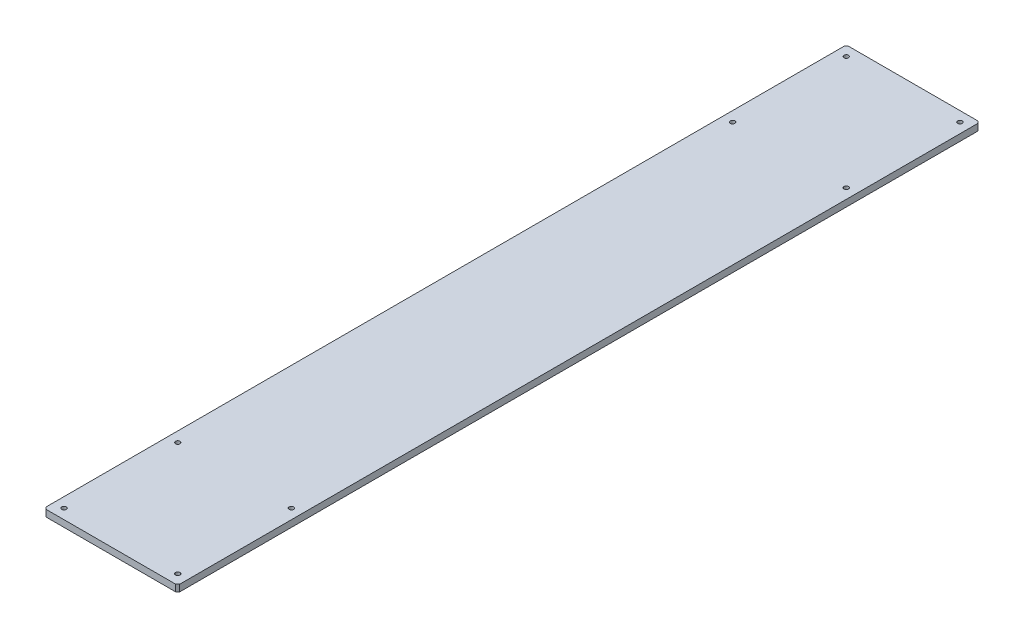
ISO-10303-21;
HEADER;
FILE_DESCRIPTION(('STEP AP214'),'2;1');
FILE_NAME('part.step','',(''),(''),'','','');
FILE_SCHEMA(('AUTOMOTIVE_DESIGN { 1 0 10303 214 1 1 1 1 }'));
ENDSEC;
DATA;
#1=APPLICATION_CONTEXT('core data for automotive mechanical design processes');
#2=APPLICATION_PROTOCOL_DEFINITION('international standard','automotive_design',2000,#1);
#3=PRODUCT_CONTEXT('',#1,'mechanical');
#4=PRODUCT('Part','Part','',(#3));
#5=PRODUCT_RELATED_PRODUCT_CATEGORY('part','',(#4));
#6=PRODUCT_DEFINITION_FORMATION('','',#4);
#7=PRODUCT_DEFINITION_CONTEXT('part definition',#1,'design');
#8=PRODUCT_DEFINITION('design','',#6,#7);
#9=PRODUCT_DEFINITION_SHAPE('','',#8);
#10=(LENGTH_UNIT() NAMED_UNIT(*) SI_UNIT(.MILLI.,.METRE.));
#11=(NAMED_UNIT(*) PLANE_ANGLE_UNIT() SI_UNIT($,.RADIAN.));
#12=(NAMED_UNIT(*) SI_UNIT($,.STERADIAN.) SOLID_ANGLE_UNIT());
#13=UNCERTAINTY_MEASURE_WITH_UNIT(LENGTH_MEASURE(1.E-05),#10,'distance_accuracy_value','');
#14=(GEOMETRIC_REPRESENTATION_CONTEXT(3) GLOBAL_UNCERTAINTY_ASSIGNED_CONTEXT((#13)) GLOBAL_UNIT_ASSIGNED_CONTEXT((#10,
#11,#12)) REPRESENTATION_CONTEXT('',''));
#15=CARTESIAN_POINT('',(0.,0.,0.));
#16=DIRECTION('',(0.,0.,1.));
#17=DIRECTION('',(1.,0.,0.));
#18=AXIS2_PLACEMENT_3D('',#15,#16,#17);
#19=CARTESIAN_POINT('',(1.16341445918999E-13,10.,-600.));
#20=DIRECTION('',(1.,0.,0.));
#21=DIRECTION('',(0.,0.,-1.));
#22=AXIS2_PLACEMENT_3D('',#19,#20,#21);
#23=PLANE('',#22);
#24=DIRECTION('',(0.,0.,1.));
#25=VECTOR('',#24,1.);
#26=CARTESIAN_POINT('',(1.16341445918999E-13,0.,-600.));
#27=LINE('',#26,#25);
#28=CARTESIAN_POINT('',(1.16341445918999E-13,0.,-597.));
#29=VERTEX_POINT('',#28);
#30=CARTESIAN_POINT('',(1.16341445918999E-13,0.,597.));
#31=VERTEX_POINT('',#30);
#32=EDGE_CURVE('E138',#29,#31,#27,.T.);
#33=ORIENTED_EDGE('',*,*,#32,.T.);
#34=DIRECTION('',(0.,1.,0.));
#35=VECTOR('',#34,1.);
#36=CARTESIAN_POINT('',(1.16341445918999E-13,10.,597.));
#37=LINE('',#36,#35);
#38=CARTESIAN_POINT('',(1.16341445918999E-13,10.,597.));
#39=VERTEX_POINT('',#38);
#40=EDGE_CURVE('E116',#31,#39,#37,.T.);
#41=ORIENTED_EDGE('',*,*,#40,.T.);
#42=DIRECTION('',(0.,0.,1.));
#43=VECTOR('',#42,1.);
#44=CARTESIAN_POINT('',(1.16341445918999E-13,10.,-600.));
#45=LINE('',#44,#43);
#46=CARTESIAN_POINT('',(1.16341445918999E-13,10.,-597.));
#47=VERTEX_POINT('',#46);
#48=EDGE_CURVE('E148',#47,#39,#45,.T.);
#49=ORIENTED_EDGE('',*,*,#48,.F.);
#50=DIRECTION('',(0.,-1.,0.));
#51=VECTOR('',#50,1.);
#52=CARTESIAN_POINT('',(1.16341445918999E-13,10.,-597.));
#53=LINE('',#52,#51);
#54=EDGE_CURVE('E121',#47,#29,#53,.T.);
#55=ORIENTED_EDGE('',*,*,#54,.T.);
#56=EDGE_LOOP('',(#33,#41,#49,#55));
#57=FACE_BOUND('',#56,.T.);
#58=ADVANCED_FACE('F45',(#57),#23,.F.);
#59=CARTESIAN_POINT('',(1.16341445918999E-13,10.,600.));
#60=DIRECTION('',(0.,0.,-1.));
#61=DIRECTION('',(-1.,0.,0.));
#62=AXIS2_PLACEMENT_3D('',#59,#60,#61);
#63=PLANE('',#62);
#64=DIRECTION('',(1.,0.,0.));
#65=VECTOR('',#64,1.);
#66=CARTESIAN_POINT('',(1.16341445918999E-13,10.,600.));
#67=LINE('',#66,#65);
#68=CARTESIAN_POINT('',(3.00000000000012,10.,600.));
#69=VERTEX_POINT('',#68);
#70=CARTESIAN_POINT('',(197.,10.,600.));
#71=VERTEX_POINT('',#70);
#72=EDGE_CURVE('E131',#69,#71,#67,.T.);
#73=ORIENTED_EDGE('',*,*,#72,.F.);
#74=DIRECTION('',(0.,-1.,0.));
#75=VECTOR('',#74,1.);
#76=CARTESIAN_POINT('',(3.00000000000012,10.,600.));
#77=LINE('',#76,#75);
#78=CARTESIAN_POINT('',(3.00000000000012,0.,600.));
#79=VERTEX_POINT('',#78);
#80=EDGE_CURVE('E115',#69,#79,#77,.T.);
#81=ORIENTED_EDGE('',*,*,#80,.T.);
#82=DIRECTION('',(1.,0.,0.));
#83=VECTOR('',#82,1.);
#84=CARTESIAN_POINT('',(1.16341445918999E-13,0.,600.));
#85=LINE('',#84,#83);
#86=CARTESIAN_POINT('',(197.,0.,600.));
#87=VERTEX_POINT('',#86);
#88=EDGE_CURVE('E128',#79,#87,#85,.T.);
#89=ORIENTED_EDGE('',*,*,#88,.T.);
#90=DIRECTION('',(0.,1.,0.));
#91=VECTOR('',#90,1.);
#92=CARTESIAN_POINT('',(197.,10.,600.));
#93=LINE('',#92,#91);
#94=EDGE_CURVE('E133',#87,#71,#93,.T.);
#95=ORIENTED_EDGE('',*,*,#94,.T.);
#96=EDGE_LOOP('',(#73,#81,#89,#95));
#97=FACE_BOUND('',#96,.T.);
#98=ADVANCED_FACE('F127',(#97),#63,.F.);
#99=CARTESIAN_POINT('',(200.,10.,-600.));
#100=DIRECTION('',(-1.,0.,0.));
#101=DIRECTION('',(0.,0.,1.));
#102=AXIS2_PLACEMENT_3D('',#99,#100,#101);
#103=PLANE('',#102);
#104=DIRECTION('',(0.,0.,-1.));
#105=VECTOR('',#104,1.);
#106=CARTESIAN_POINT('',(200.,10.,-600.));
#107=LINE('',#106,#105);
#108=CARTESIAN_POINT('',(200.,10.,597.));
#109=VERTEX_POINT('',#108);
#110=CARTESIAN_POINT('',(200.,10.,-597.));
#111=VERTEX_POINT('',#110);
#112=EDGE_CURVE('E174',#109,#111,#107,.T.);
#113=ORIENTED_EDGE('',*,*,#112,.F.);
#114=DIRECTION('',(0.,-1.,0.));
#115=VECTOR('',#114,1.);
#116=CARTESIAN_POINT('',(200.,10.,597.));
#117=LINE('',#116,#115);
#118=CARTESIAN_POINT('',(200.,0.,597.));
#119=VERTEX_POINT('',#118);
#120=EDGE_CURVE('E167',#109,#119,#117,.T.);
#121=ORIENTED_EDGE('',*,*,#120,.T.);
#122=DIRECTION('',(0.,0.,-1.));
#123=VECTOR('',#122,1.);
#124=CARTESIAN_POINT('',(200.,0.,-600.));
#125=LINE('',#124,#123);
#126=CARTESIAN_POINT('',(200.,0.,-597.));
#127=VERTEX_POINT('',#126);
#128=EDGE_CURVE('E137',#119,#127,#125,.T.);
#129=ORIENTED_EDGE('',*,*,#128,.T.);
#130=DIRECTION('',(0.,1.,0.));
#131=VECTOR('',#130,1.);
#132=CARTESIAN_POINT('',(200.,10.,-597.));
#133=LINE('',#132,#131);
#134=EDGE_CURVE('E165',#127,#111,#133,.T.);
#135=ORIENTED_EDGE('',*,*,#134,.T.);
#136=EDGE_LOOP('',(#113,#121,#129,#135));
#137=FACE_BOUND('',#136,.T.);
#138=ADVANCED_FACE('F172',(#137),#103,.F.);
#139=CARTESIAN_POINT('',(1.16341445918999E-13,10.,-600.));
#140=DIRECTION('',(0.,0.,1.));
#141=DIRECTION('',(1.,0.,0.));
#142=AXIS2_PLACEMENT_3D('',#139,#140,#141);
#143=PLANE('',#142);
#144=DIRECTION('',(-1.,0.,0.));
#145=VECTOR('',#144,1.);
#146=CARTESIAN_POINT('',(1.16341445918999E-13,10.,-600.));
#147=LINE('',#146,#145);
#148=CARTESIAN_POINT('',(197.,10.,-600.));
#149=VERTEX_POINT('',#148);
#150=CARTESIAN_POINT('',(3.00000000000012,10.,-600.));
#151=VERTEX_POINT('',#150);
#152=EDGE_CURVE('E149',#149,#151,#147,.T.);
#153=ORIENTED_EDGE('',*,*,#152,.F.);
#154=DIRECTION('',(0.,-1.,0.));
#155=VECTOR('',#154,1.);
#156=CARTESIAN_POINT('',(197.,10.,-600.));
#157=LINE('',#156,#155);
#158=CARTESIAN_POINT('',(197.,0.,-600.));
#159=VERTEX_POINT('',#158);
#160=EDGE_CURVE('E11',#149,#159,#157,.T.);
#161=ORIENTED_EDGE('',*,*,#160,.T.);
#162=DIRECTION('',(-1.,0.,0.));
#163=VECTOR('',#162,1.);
#164=CARTESIAN_POINT('',(1.16341445918999E-13,0.,-600.));
#165=LINE('',#164,#163);
#166=CARTESIAN_POINT('',(3.00000000000012,0.,-600.));
#167=VERTEX_POINT('',#166);
#168=EDGE_CURVE('E141',#159,#167,#165,.T.);
#169=ORIENTED_EDGE('',*,*,#168,.T.);
#170=DIRECTION('',(0.,1.,0.));
#171=VECTOR('',#170,1.);
#172=CARTESIAN_POINT('',(3.00000000000012,10.,-600.));
#173=LINE('',#172,#171);
#174=EDGE_CURVE('E53',#167,#151,#173,.T.);
#175=ORIENTED_EDGE('',*,*,#174,.T.);
#176=EDGE_LOOP('',(#153,#161,#169,#175));
#177=FACE_BOUND('',#176,.T.);
#178=ADVANCED_FACE('F181',(#177),#143,.F.);
#179=CARTESIAN_POINT('',(1.16341445918999E-13,10.,600.));
#180=DIRECTION('',(0.,1.,0.));
#181=DIRECTION('',(0.,0.,1.));
#182=AXIS2_PLACEMENT_3D('',#179,#180,#181);
#183=PLANE('',#182);
#184=CARTESIAN_POINT('',(15.,10.,-585.));
#185=DIRECTION('',(0.,1.,0.));
#186=DIRECTION('',(0.,0.,1.));
#187=AXIS2_PLACEMENT_3D('',#184,#185,#186);
#188=CIRCLE('',#187,3.39999999999999);
#189=CARTESIAN_POINT('',(15.,10.,-581.6));
#190=VERTEX_POINT('',#189);
#191=EDGE_CURVE('E232',#190,#190,#188,.T.);
#192=ORIENTED_EDGE('',*,*,#191,.F.);
#193=EDGE_LOOP('',(#192));
#194=FACE_BOUND('',#193,.T.);
#195=CARTESIAN_POINT('',(15.,10.,-415.));
#196=DIRECTION('',(0.,1.,0.));
#197=DIRECTION('',(0.,0.,1.));
#198=AXIS2_PLACEMENT_3D('',#195,#196,#197);
#199=CIRCLE('',#198,3.39999999999999);
#200=CARTESIAN_POINT('',(15.,10.,-411.6));
#201=VERTEX_POINT('',#200);
#202=EDGE_CURVE('E226',#201,#201,#199,.T.);
#203=ORIENTED_EDGE('',*,*,#202,.F.);
#204=EDGE_LOOP('',(#203));
#205=FACE_BOUND('',#204,.T.);
#206=CARTESIAN_POINT('',(185.,10.,-415.));
#207=DIRECTION('',(0.,1.,0.));
#208=DIRECTION('',(0.,0.,1.));
#209=AXIS2_PLACEMENT_3D('',#206,#207,#208);
#210=CIRCLE('',#209,3.39999999999999);
#211=CARTESIAN_POINT('',(185.,10.,-411.6));
#212=VERTEX_POINT('',#211);
#213=EDGE_CURVE('E220',#212,#212,#210,.T.);
#214=ORIENTED_EDGE('',*,*,#213,.F.);
#215=EDGE_LOOP('',(#214));
#216=FACE_BOUND('',#215,.T.);
#217=CARTESIAN_POINT('',(185.,10.,-585.));
#218=DIRECTION('',(0.,1.,0.));
#219=DIRECTION('',(0.,0.,1.));
#220=AXIS2_PLACEMENT_3D('',#217,#218,#219);
#221=CIRCLE('',#220,3.39999999999999);
#222=CARTESIAN_POINT('',(185.,10.,-581.6));
#223=VERTEX_POINT('',#222);
#224=EDGE_CURVE('E214',#223,#223,#221,.T.);
#225=ORIENTED_EDGE('',*,*,#224,.F.);
#226=EDGE_LOOP('',(#225));
#227=FACE_BOUND('',#226,.T.);
#228=CARTESIAN_POINT('',(185.,10.,415.));
#229=DIRECTION('',(0.,1.,0.));
#230=DIRECTION('',(0.,0.,1.));
#231=AXIS2_PLACEMENT_3D('',#228,#229,#230);
#232=CIRCLE('',#231,3.39999999999999);
#233=CARTESIAN_POINT('',(185.,10.,418.4));
#234=VERTEX_POINT('',#233);
#235=EDGE_CURVE('E208',#234,#234,#232,.T.);
#236=ORIENTED_EDGE('',*,*,#235,.F.);
#237=EDGE_LOOP('',(#236));
#238=FACE_BOUND('',#237,.T.);
#239=CARTESIAN_POINT('',(185.,10.,585.));
#240=DIRECTION('',(0.,1.,0.));
#241=DIRECTION('',(0.,0.,1.));
#242=AXIS2_PLACEMENT_3D('',#239,#240,#241);
#243=CIRCLE('',#242,3.39999999999999);
#244=CARTESIAN_POINT('',(185.,10.,588.4));
#245=VERTEX_POINT('',#244);
#246=EDGE_CURVE('E202',#245,#245,#243,.T.);
#247=ORIENTED_EDGE('',*,*,#246,.F.);
#248=EDGE_LOOP('',(#247));
#249=FACE_BOUND('',#248,.T.);
#250=CARTESIAN_POINT('',(15.0000000000001,10.,585.));
#251=DIRECTION('',(0.,1.,0.));
#252=DIRECTION('',(0.,0.,1.));
#253=AXIS2_PLACEMENT_3D('',#250,#251,#252);
#254=CIRCLE('',#253,3.39999999999999);
#255=CARTESIAN_POINT('',(15.0000000000001,10.,588.4));
#256=VERTEX_POINT('',#255);
#257=EDGE_CURVE('E196',#256,#256,#254,.T.);
#258=ORIENTED_EDGE('',*,*,#257,.F.);
#259=EDGE_LOOP('',(#258));
#260=FACE_BOUND('',#259,.T.);
#261=CARTESIAN_POINT('',(15.0000000000001,10.,415.));
#262=DIRECTION('',(0.,1.,0.));
#263=DIRECTION('',(0.,0.,1.));
#264=AXIS2_PLACEMENT_3D('',#261,#262,#263);
#265=CIRCLE('',#264,3.39999999999999);
#266=CARTESIAN_POINT('',(15.0000000000001,10.,418.4));
#267=VERTEX_POINT('',#266);
#268=EDGE_CURVE('E190',#267,#267,#265,.T.);
#269=ORIENTED_EDGE('',*,*,#268,.F.);
#270=EDGE_LOOP('',(#269));
#271=FACE_BOUND('',#270,.T.);
#272=ORIENTED_EDGE('',*,*,#48,.T.);
#273=DIRECTION('',(-0.707106781186561,0.,-0.707106781186534));
#274=VECTOR('',#273,1.);
#275=CARTESIAN_POINT('',(1.50000000000006,10.,598.5));
#276=LINE('',#275,#274);
#277=EDGE_CURVE('E163',#39,#69,#276,.F.);
#278=ORIENTED_EDGE('',*,*,#277,.T.);
#279=ORIENTED_EDGE('',*,*,#72,.T.);
#280=DIRECTION('',(-0.707106781186561,0.,0.707106781186534));
#281=VECTOR('',#280,1.);
#282=CARTESIAN_POINT('',(98.4999999999965,10.,698.5));
#283=LINE('',#282,#281);
#284=EDGE_CURVE('E161',#71,#109,#283,.F.);
#285=ORIENTED_EDGE('',*,*,#284,.T.);
#286=ORIENTED_EDGE('',*,*,#112,.T.);
#287=DIRECTION('',(0.707106781186548,0.,0.707106781186548));
#288=VECTOR('',#287,1.);
#289=CARTESIAN_POINT('',(698.5,10.,-98.4999999999998));
#290=LINE('',#289,#288);
#291=EDGE_CURVE('E66',#111,#149,#290,.F.);
#292=ORIENTED_EDGE('',*,*,#291,.T.);
#293=ORIENTED_EDGE('',*,*,#152,.T.);
#294=DIRECTION('',(0.707106781186548,0.,-0.707106781186548));
#295=VECTOR('',#294,1.);
#296=CARTESIAN_POINT('',(-598.5,10.,1.49999999999995));
#297=LINE('',#296,#295);
#298=EDGE_CURVE('E158',#151,#47,#297,.F.);
#299=ORIENTED_EDGE('',*,*,#298,.T.);
#300=EDGE_LOOP('',(#272,#278,#279,#285,#286,#292,#293,#299));
#301=FACE_BOUND('',#300,.T.);
#302=ADVANCED_FACE('F238',(#194,#205,#216,#227,#238,#249,#260,#271,#301),#183,.T.);
#303=CARTESIAN_POINT('',(1.16341445918999E-13,0.,600.));
#304=DIRECTION('',(0.,1.,0.));
#305=DIRECTION('',(0.,0.,1.));
#306=AXIS2_PLACEMENT_3D('',#303,#304,#305);
#307=PLANE('',#306);
#308=CARTESIAN_POINT('',(15.,0.,-585.));
#309=DIRECTION('',(0.,1.,0.));
#310=DIRECTION('',(0.,0.,1.));
#311=AXIS2_PLACEMENT_3D('',#308,#309,#310);
#312=CIRCLE('',#311,3.4);
#313=CARTESIAN_POINT('',(15.,0.,-581.6));
#314=VERTEX_POINT('',#313);
#315=EDGE_CURVE('E229',#314,#314,#312,.T.);
#316=ORIENTED_EDGE('',*,*,#315,.T.);
#317=EDGE_LOOP('',(#316));
#318=FACE_BOUND('',#317,.T.);
#319=CARTESIAN_POINT('',(15.,0.,-415.));
#320=DIRECTION('',(0.,1.,0.));
#321=DIRECTION('',(0.,0.,1.));
#322=AXIS2_PLACEMENT_3D('',#319,#320,#321);
#323=CIRCLE('',#322,3.4);
#324=CARTESIAN_POINT('',(15.,0.,-411.6));
#325=VERTEX_POINT('',#324);
#326=EDGE_CURVE('E223',#325,#325,#323,.T.);
#327=ORIENTED_EDGE('',*,*,#326,.T.);
#328=EDGE_LOOP('',(#327));
#329=FACE_BOUND('',#328,.T.);
#330=CARTESIAN_POINT('',(185.,0.,-415.));
#331=DIRECTION('',(0.,1.,0.));
#332=DIRECTION('',(0.,0.,1.));
#333=AXIS2_PLACEMENT_3D('',#330,#331,#332);
#334=CIRCLE('',#333,3.39999999999999);
#335=CARTESIAN_POINT('',(185.,0.,-411.6));
#336=VERTEX_POINT('',#335);
#337=EDGE_CURVE('E217',#336,#336,#334,.T.);
#338=ORIENTED_EDGE('',*,*,#337,.T.);
#339=EDGE_LOOP('',(#338));
#340=FACE_BOUND('',#339,.T.);
#341=CARTESIAN_POINT('',(185.,0.,-585.));
#342=DIRECTION('',(0.,1.,0.));
#343=DIRECTION('',(0.,0.,1.));
#344=AXIS2_PLACEMENT_3D('',#341,#342,#343);
#345=CIRCLE('',#344,3.39999999999999);
#346=CARTESIAN_POINT('',(185.,0.,-581.6));
#347=VERTEX_POINT('',#346);
#348=EDGE_CURVE('E211',#347,#347,#345,.T.);
#349=ORIENTED_EDGE('',*,*,#348,.T.);
#350=EDGE_LOOP('',(#349));
#351=FACE_BOUND('',#350,.T.);
#352=CARTESIAN_POINT('',(185.,0.,415.));
#353=DIRECTION('',(0.,1.,0.));
#354=DIRECTION('',(0.,0.,1.));
#355=AXIS2_PLACEMENT_3D('',#352,#353,#354);
#356=CIRCLE('',#355,3.39999999999999);
#357=CARTESIAN_POINT('',(185.,0.,418.4));
#358=VERTEX_POINT('',#357);
#359=EDGE_CURVE('E205',#358,#358,#356,.T.);
#360=ORIENTED_EDGE('',*,*,#359,.T.);
#361=EDGE_LOOP('',(#360));
#362=FACE_BOUND('',#361,.T.);
#363=CARTESIAN_POINT('',(185.,0.,585.));
#364=DIRECTION('',(0.,1.,0.));
#365=DIRECTION('',(0.,0.,1.));
#366=AXIS2_PLACEMENT_3D('',#363,#364,#365);
#367=CIRCLE('',#366,3.39999999999999);
#368=CARTESIAN_POINT('',(185.,0.,588.4));
#369=VERTEX_POINT('',#368);
#370=EDGE_CURVE('E199',#369,#369,#367,.T.);
#371=ORIENTED_EDGE('',*,*,#370,.T.);
#372=EDGE_LOOP('',(#371));
#373=FACE_BOUND('',#372,.T.);
#374=CARTESIAN_POINT('',(15.0000000000001,0.,585.));
#375=DIRECTION('',(0.,1.,0.));
#376=DIRECTION('',(0.,0.,1.));
#377=AXIS2_PLACEMENT_3D('',#374,#375,#376);
#378=CIRCLE('',#377,3.4);
#379=CARTESIAN_POINT('',(15.0000000000001,0.,588.4));
#380=VERTEX_POINT('',#379);
#381=EDGE_CURVE('E193',#380,#380,#378,.T.);
#382=ORIENTED_EDGE('',*,*,#381,.T.);
#383=EDGE_LOOP('',(#382));
#384=FACE_BOUND('',#383,.T.);
#385=CARTESIAN_POINT('',(15.0000000000001,0.,415.));
#386=DIRECTION('',(0.,1.,0.));
#387=DIRECTION('',(0.,0.,1.));
#388=AXIS2_PLACEMENT_3D('',#385,#386,#387);
#389=CIRCLE('',#388,3.4);
#390=CARTESIAN_POINT('',(15.0000000000001,0.,418.4));
#391=VERTEX_POINT('',#390);
#392=EDGE_CURVE('E143',#391,#391,#389,.T.);
#393=ORIENTED_EDGE('',*,*,#392,.T.);
#394=EDGE_LOOP('',(#393));
#395=FACE_BOUND('',#394,.T.);
#396=ORIENTED_EDGE('',*,*,#88,.F.);
#397=DIRECTION('',(0.707106781186561,0.,0.707106781186534));
#398=VECTOR('',#397,1.);
#399=CARTESIAN_POINT('',(3.00000000000012,0.,600.));
#400=LINE('',#399,#398);
#401=EDGE_CURVE('E111',#79,#31,#400,.F.);
#402=ORIENTED_EDGE('',*,*,#401,.T.);
#403=ORIENTED_EDGE('',*,*,#32,.F.);
#404=DIRECTION('',(-0.707106781186548,0.,0.707106781186548));
#405=VECTOR('',#404,1.);
#406=CARTESIAN_POINT('',(1.16341445918999E-13,0.,-597.));
#407=LINE('',#406,#405);
#408=EDGE_CURVE('E132',#29,#167,#407,.F.);
#409=ORIENTED_EDGE('',*,*,#408,.T.);
#410=ORIENTED_EDGE('',*,*,#168,.F.);
#411=DIRECTION('',(-0.707106781186548,0.,-0.707106781186548));
#412=VECTOR('',#411,1.);
#413=CARTESIAN_POINT('',(197.,0.,-600.));
#414=LINE('',#413,#412);
#415=EDGE_CURVE('E152',#159,#127,#414,.F.);
#416=ORIENTED_EDGE('',*,*,#415,.T.);
#417=ORIENTED_EDGE('',*,*,#128,.F.);
#418=DIRECTION('',(0.707106781186561,0.,-0.707106781186534));
#419=VECTOR('',#418,1.);
#420=CARTESIAN_POINT('',(200.,0.,597.));
#421=LINE('',#420,#419);
#422=EDGE_CURVE('E122',#119,#87,#421,.F.);
#423=ORIENTED_EDGE('',*,*,#422,.T.);
#424=EDGE_LOOP('',(#396,#402,#403,#409,#410,#416,#417,#423));
#425=FACE_BOUND('',#424,.T.);
#426=ADVANCED_FACE('F135',(#318,#329,#340,#351,#362,#373,#384,#395,#425),#307,.F.);
#427=CARTESIAN_POINT('',(15.0000000000001,10.,415.));
#428=DIRECTION('',(0.,1.,0.));
#429=DIRECTION('',(0.,0.,1.));
#430=AXIS2_PLACEMENT_3D('',#427,#428,#429);
#431=CYLINDRICAL_SURFACE('',#430,3.39999999999999);
#432=ORIENTED_EDGE('',*,*,#392,.F.);
#433=EDGE_LOOP('',(#432));
#434=FACE_BOUND('',#433,.T.);
#435=ORIENTED_EDGE('',*,*,#268,.T.);
#436=EDGE_LOOP('',(#435));
#437=FACE_BOUND('',#436,.T.);
#438=ADVANCED_FACE('F363',(#434,#437),#431,.F.);
#439=CARTESIAN_POINT('',(15.0000000000001,10.,585.));
#440=DIRECTION('',(0.,1.,0.));
#441=DIRECTION('',(0.,0.,1.));
#442=AXIS2_PLACEMENT_3D('',#439,#440,#441);
#443=CYLINDRICAL_SURFACE('',#442,3.39999999999999);
#444=ORIENTED_EDGE('',*,*,#381,.F.);
#445=EDGE_LOOP('',(#444));
#446=FACE_BOUND('',#445,.T.);
#447=ORIENTED_EDGE('',*,*,#257,.T.);
#448=EDGE_LOOP('',(#447));
#449=FACE_BOUND('',#448,.T.);
#450=ADVANCED_FACE('F353',(#446,#449),#443,.F.);
#451=CARTESIAN_POINT('',(185.,10.,585.));
#452=DIRECTION('',(0.,1.,0.));
#453=DIRECTION('',(0.,0.,1.));
#454=AXIS2_PLACEMENT_3D('',#451,#452,#453);
#455=CYLINDRICAL_SURFACE('',#454,3.39999999999999);
#456=ORIENTED_EDGE('',*,*,#370,.F.);
#457=EDGE_LOOP('',(#456));
#458=FACE_BOUND('',#457,.T.);
#459=ORIENTED_EDGE('',*,*,#246,.T.);
#460=EDGE_LOOP('',(#459));
#461=FACE_BOUND('',#460,.T.);
#462=ADVANCED_FACE('F343',(#458,#461),#455,.F.);
#463=CARTESIAN_POINT('',(185.,10.,415.));
#464=DIRECTION('',(0.,1.,0.));
#465=DIRECTION('',(0.,0.,1.));
#466=AXIS2_PLACEMENT_3D('',#463,#464,#465);
#467=CYLINDRICAL_SURFACE('',#466,3.39999999999999);
#468=ORIENTED_EDGE('',*,*,#359,.F.);
#469=EDGE_LOOP('',(#468));
#470=FACE_BOUND('',#469,.T.);
#471=ORIENTED_EDGE('',*,*,#235,.T.);
#472=EDGE_LOOP('',(#471));
#473=FACE_BOUND('',#472,.T.);
#474=ADVANCED_FACE('F333',(#470,#473),#467,.F.);
#475=CARTESIAN_POINT('',(185.,10.,-585.));
#476=DIRECTION('',(0.,1.,0.));
#477=DIRECTION('',(0.,0.,1.));
#478=AXIS2_PLACEMENT_3D('',#475,#476,#477);
#479=CYLINDRICAL_SURFACE('',#478,3.39999999999999);
#480=ORIENTED_EDGE('',*,*,#348,.F.);
#481=EDGE_LOOP('',(#480));
#482=FACE_BOUND('',#481,.T.);
#483=ORIENTED_EDGE('',*,*,#224,.T.);
#484=EDGE_LOOP('',(#483));
#485=FACE_BOUND('',#484,.T.);
#486=ADVANCED_FACE('F323',(#482,#485),#479,.F.);
#487=CARTESIAN_POINT('',(185.,10.,-415.));
#488=DIRECTION('',(0.,1.,0.));
#489=DIRECTION('',(0.,0.,1.));
#490=AXIS2_PLACEMENT_3D('',#487,#488,#489);
#491=CYLINDRICAL_SURFACE('',#490,3.39999999999999);
#492=ORIENTED_EDGE('',*,*,#337,.F.);
#493=EDGE_LOOP('',(#492));
#494=FACE_BOUND('',#493,.T.);
#495=ORIENTED_EDGE('',*,*,#213,.T.);
#496=EDGE_LOOP('',(#495));
#497=FACE_BOUND('',#496,.T.);
#498=ADVANCED_FACE('F313',(#494,#497),#491,.F.);
#499=CARTESIAN_POINT('',(15.,10.,-415.));
#500=DIRECTION('',(0.,1.,0.));
#501=DIRECTION('',(0.,0.,1.));
#502=AXIS2_PLACEMENT_3D('',#499,#500,#501);
#503=CYLINDRICAL_SURFACE('',#502,3.39999999999999);
#504=ORIENTED_EDGE('',*,*,#326,.F.);
#505=EDGE_LOOP('',(#504));
#506=FACE_BOUND('',#505,.T.);
#507=ORIENTED_EDGE('',*,*,#202,.T.);
#508=EDGE_LOOP('',(#507));
#509=FACE_BOUND('',#508,.T.);
#510=ADVANCED_FACE('F304',(#506,#509),#503,.F.);
#511=CARTESIAN_POINT('',(15.,10.,-585.));
#512=DIRECTION('',(0.,1.,0.));
#513=DIRECTION('',(0.,0.,1.));
#514=AXIS2_PLACEMENT_3D('',#511,#512,#513);
#515=CYLINDRICAL_SURFACE('',#514,3.39999999999999);
#516=ORIENTED_EDGE('',*,*,#315,.F.);
#517=EDGE_LOOP('',(#516));
#518=FACE_BOUND('',#517,.T.);
#519=ORIENTED_EDGE('',*,*,#191,.T.);
#520=EDGE_LOOP('',(#519));
#521=FACE_BOUND('',#520,.T.);
#522=ADVANCED_FACE('F236',(#518,#521),#515,.F.);
#523=CARTESIAN_POINT('',(3.00000000000012,10.,600.));
#524=DIRECTION('',(0.707106781186534,0.,-0.707106781186561));
#525=DIRECTION('',(-0.707106781186561,0.,-0.707106781186534));
#526=AXIS2_PLACEMENT_3D('',#523,#524,#525);
#527=PLANE('',#526);
#528=ORIENTED_EDGE('',*,*,#277,.F.);
#529=ORIENTED_EDGE('',*,*,#40,.F.);
#530=ORIENTED_EDGE('',*,*,#401,.F.);
#531=ORIENTED_EDGE('',*,*,#80,.F.);
#532=EDGE_LOOP('',(#528,#529,#530,#531));
#533=FACE_BOUND('',#532,.T.);
#534=ADVANCED_FACE('F114',(#533),#527,.F.);
#535=CARTESIAN_POINT('',(200.,10.,597.));
#536=DIRECTION('',(-0.707106781186534,0.,-0.707106781186561));
#537=DIRECTION('',(-0.707106781186561,0.,0.707106781186534));
#538=AXIS2_PLACEMENT_3D('',#535,#536,#537);
#539=PLANE('',#538);
#540=ORIENTED_EDGE('',*,*,#284,.F.);
#541=ORIENTED_EDGE('',*,*,#94,.F.);
#542=ORIENTED_EDGE('',*,*,#422,.F.);
#543=ORIENTED_EDGE('',*,*,#120,.F.);
#544=EDGE_LOOP('',(#540,#541,#542,#543));
#545=FACE_BOUND('',#544,.T.);
#546=ADVANCED_FACE('F263',(#545),#539,.F.);
#547=CARTESIAN_POINT('',(197.,10.,-600.));
#548=DIRECTION('',(-0.707106781186547,0.,0.707106781186547));
#549=DIRECTION('',(0.707106781186548,0.,0.707106781186548));
#550=AXIS2_PLACEMENT_3D('',#547,#548,#549);
#551=PLANE('',#550);
#552=ORIENTED_EDGE('',*,*,#291,.F.);
#553=ORIENTED_EDGE('',*,*,#134,.F.);
#554=ORIENTED_EDGE('',*,*,#415,.F.);
#555=ORIENTED_EDGE('',*,*,#160,.F.);
#556=EDGE_LOOP('',(#552,#553,#554,#555));
#557=FACE_BOUND('',#556,.T.);
#558=ADVANCED_FACE('F180',(#557),#551,.F.);
#559=CARTESIAN_POINT('',(1.16341445918999E-13,10.,-597.));
#560=DIRECTION('',(0.707106781186547,0.,0.707106781186547));
#561=DIRECTION('',(0.707106781186548,0.,-0.707106781186548));
#562=AXIS2_PLACEMENT_3D('',#559,#560,#561);
#563=PLANE('',#562);
#564=ORIENTED_EDGE('',*,*,#298,.F.);
#565=ORIENTED_EDGE('',*,*,#174,.F.);
#566=ORIENTED_EDGE('',*,*,#408,.F.);
#567=ORIENTED_EDGE('',*,*,#54,.F.);
#568=EDGE_LOOP('',(#564,#565,#566,#567));
#569=FACE_BOUND('',#568,.T.);
#570=ADVANCED_FACE('F47',(#569),#563,.F.);
#571=CLOSED_SHELL('',(#58,#98,#138,#178,#302,#426,#438,#450,#462,#474,#486,#498,#510,#522,#534,
#546,#558,#570));
#572=MANIFOLD_SOLID_BREP('B2',#571);
#573=ADVANCED_BREP_SHAPE_REPRESENTATION('',(#18,#572),#14);
#574=SHAPE_DEFINITION_REPRESENTATION(#9,#573);
ENDSEC;
END-ISO-10303-21;
